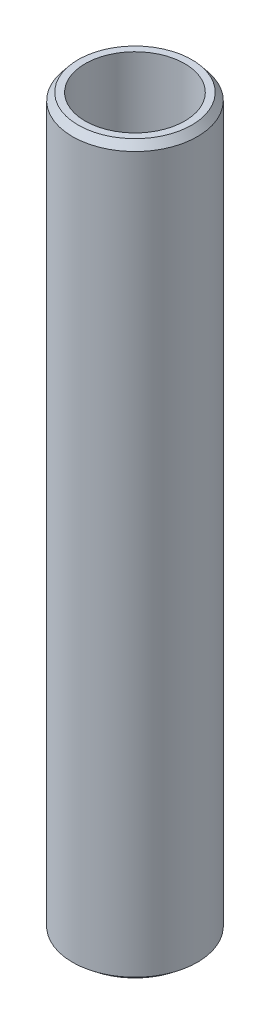
ISO-10303-21;
HEADER;
FILE_DESCRIPTION(('STEP AP214'),'2;1');
FILE_NAME('part.step','',(''),(''),'','','');
FILE_SCHEMA(('AUTOMOTIVE_DESIGN { 1 0 10303 214 1 1 1 1 }'));
ENDSEC;
DATA;
#1=APPLICATION_CONTEXT('core data for automotive mechanical design processes');
#2=APPLICATION_PROTOCOL_DEFINITION('international standard','automotive_design',2000,#1);
#3=PRODUCT_CONTEXT('',#1,'mechanical');
#4=PRODUCT('Part','Part','',(#3));
#5=PRODUCT_RELATED_PRODUCT_CATEGORY('part','',(#4));
#6=PRODUCT_DEFINITION_FORMATION('','',#4);
#7=PRODUCT_DEFINITION_CONTEXT('part definition',#1,'design');
#8=PRODUCT_DEFINITION('design','',#6,#7);
#9=PRODUCT_DEFINITION_SHAPE('','',#8);
#10=(LENGTH_UNIT() NAMED_UNIT(*) SI_UNIT(.MILLI.,.METRE.));
#11=(NAMED_UNIT(*) PLANE_ANGLE_UNIT() SI_UNIT($,.RADIAN.));
#12=(NAMED_UNIT(*) SI_UNIT($,.STERADIAN.) SOLID_ANGLE_UNIT());
#13=UNCERTAINTY_MEASURE_WITH_UNIT(LENGTH_MEASURE(1.E-05),#10,'distance_accuracy_value','');
#14=(GEOMETRIC_REPRESENTATION_CONTEXT(3) GLOBAL_UNCERTAINTY_ASSIGNED_CONTEXT((#13)) GLOBAL_UNIT_ASSIGNED_CONTEXT((#10,
#11,#12)) REPRESENTATION_CONTEXT('',''));
#15=CARTESIAN_POINT('',(0.,0.,0.));
#16=DIRECTION('',(0.,0.,1.));
#17=DIRECTION('',(1.,0.,0.));
#18=AXIS2_PLACEMENT_3D('',#15,#16,#17);
#19=CARTESIAN_POINT('',(0.,262.145483904681,0.));
#20=DIRECTION('',(0.,-1.,0.));
#21=DIRECTION('',(0.,0.,-1.));
#22=AXIS2_PLACEMENT_3D('',#19,#20,#21);
#23=CYLINDRICAL_SURFACE('',#22,22.5);
#24=CARTESIAN_POINT('',(0.,259.579594806273,0.));
#25=DIRECTION('',(0.,1.,0.));
#26=DIRECTION('',(0.,0.,1.));
#27=AXIS2_PLACEMENT_3D('',#24,#25,#26);
#28=CIRCLE('',#27,22.5);
#29=CARTESIAN_POINT('',(0.,259.579594806273,22.5));
#30=VERTEX_POINT('',#29);
#31=EDGE_CURVE('E50',#30,#30,#28,.F.);
#32=ORIENTED_EDGE('',*,*,#31,.T.);
#33=EDGE_LOOP('',(#32));
#34=FACE_BOUND('',#33,.T.);
#35=CARTESIAN_POINT('',(0.,2.05428594744578,0.));
#36=DIRECTION('',(0.,1.,0.));
#37=DIRECTION('',(0.,0.,1.));
#38=AXIS2_PLACEMENT_3D('',#35,#36,#37);
#39=CIRCLE('',#38,22.5);
#40=CARTESIAN_POINT('',(0.,2.05428594744578,22.5));
#41=VERTEX_POINT('',#40);
#42=EDGE_CURVE('E51',#41,#41,#39,.T.);
#43=ORIENTED_EDGE('',*,*,#42,.T.);
#44=EDGE_LOOP('',(#43));
#45=FACE_BOUND('',#44,.T.);
#46=ADVANCED_FACE('F39',(#34,#45),#23,.T.);
#47=CARTESIAN_POINT('',(0.,262.145483904681,0.));
#48=DIRECTION('',(0.,1.,0.));
#49=DIRECTION('',(0.,0.,1.));
#50=AXIS2_PLACEMENT_3D('',#47,#48,#49);
#51=PLANE('',#50);
#52=CARTESIAN_POINT('',(0.,262.145483904681,0.));
#53=DIRECTION('',(0.,1.,0.));
#54=DIRECTION('',(0.,0.,1.));
#55=AXIS2_PLACEMENT_3D('',#52,#53,#54);
#56=CIRCLE('',#55,20.4457140525542);
#57=CARTESIAN_POINT('',(0.,262.145483904681,20.4457140525542));
#58=VERTEX_POINT('',#57);
#59=EDGE_CURVE('E54',#58,#58,#56,.T.);
#60=ORIENTED_EDGE('',*,*,#59,.T.);
#61=EDGE_LOOP('',(#60));
#62=FACE_BOUND('',#61,.T.);
#63=CARTESIAN_POINT('',(0.,262.145483904681,0.));
#64=DIRECTION('',(0.,1.,0.));
#65=DIRECTION('',(0.,0.,1.));
#66=AXIS2_PLACEMENT_3D('',#63,#64,#65);
#67=CIRCLE('',#66,17.9255346033193);
#68=CARTESIAN_POINT('',(0.,262.145483904681,17.9255346033193));
#69=VERTEX_POINT('',#68);
#70=EDGE_CURVE('E58',#69,#69,#67,.T.);
#71=ORIENTED_EDGE('',*,*,#70,.F.);
#72=EDGE_LOOP('',(#71));
#73=FACE_BOUND('',#72,.T.);
#74=ADVANCED_FACE('F69',(#62,#73),#51,.T.);
#75=CARTESIAN_POINT('',(0.,0.,0.));
#76=DIRECTION('',(0.,1.,0.));
#77=DIRECTION('',(0.,0.,1.));
#78=AXIS2_PLACEMENT_3D('',#75,#76,#77);
#79=PLANE('',#78);
#80=CARTESIAN_POINT('',(0.,0.,0.));
#81=DIRECTION('',(0.,1.,0.));
#82=DIRECTION('',(0.,0.,1.));
#83=AXIS2_PLACEMENT_3D('',#80,#81,#82);
#84=CIRCLE('',#83,19.9341109015926);
#85=CARTESIAN_POINT('',(0.,0.,19.9341109015926));
#86=VERTEX_POINT('',#85);
#87=EDGE_CURVE('E10',#86,#86,#84,.F.);
#88=ORIENTED_EDGE('',*,*,#87,.T.);
#89=EDGE_LOOP('',(#88));
#90=FACE_BOUND('',#89,.T.);
#91=CARTESIAN_POINT('',(0.,0.,0.));
#92=DIRECTION('',(0.,1.,0.));
#93=DIRECTION('',(0.,0.,1.));
#94=AXIS2_PLACEMENT_3D('',#91,#92,#93);
#95=CIRCLE('',#94,17.9255346033193);
#96=CARTESIAN_POINT('',(0.,0.,17.9255346033193));
#97=VERTEX_POINT('',#96);
#98=EDGE_CURVE('E63',#97,#97,#95,.T.);
#99=ORIENTED_EDGE('',*,*,#98,.T.);
#100=EDGE_LOOP('',(#99));
#101=FACE_BOUND('',#100,.T.);
#102=ADVANCED_FACE('F75',(#90,#101),#79,.F.);
#103=CARTESIAN_POINT('',(0.,262.145483904681,0.));
#104=DIRECTION('',(0.,-1.,0.));
#105=DIRECTION('',(0.,0.,-1.));
#106=AXIS2_PLACEMENT_3D('',#103,#104,#105);
#107=CYLINDRICAL_SURFACE('',#106,17.9255346033193);
#108=ORIENTED_EDGE('',*,*,#70,.T.);
#109=EDGE_LOOP('',(#108));
#110=FACE_BOUND('',#109,.T.);
#111=ORIENTED_EDGE('',*,*,#98,.F.);
#112=EDGE_LOOP('',(#111));
#113=FACE_BOUND('',#112,.T.);
#114=ADVANCED_FACE('F70',(#110,#113),#107,.F.);
#115=CARTESIAN_POINT('',(0.,262.145483904681,0.));
#116=DIRECTION('',(0.,-1.,0.));
#117=DIRECTION('',(0.,0.,-1.));
#118=AXIS2_PLACEMENT_3D('',#115,#116,#117);
#119=CONICAL_SURFACE('',#118,20.4457140525542,0.675115033394647);
#120=ORIENTED_EDGE('',*,*,#31,.F.);
#121=EDGE_LOOP('',(#120));
#122=FACE_BOUND('',#121,.T.);
#123=ORIENTED_EDGE('',*,*,#59,.F.);
#124=EDGE_LOOP('',(#123));
#125=FACE_BOUND('',#124,.T.);
#126=ADVANCED_FACE('F81',(#122,#125),#119,.T.);
#127=CARTESIAN_POINT('',(0.,2.05428594744578,0.));
#128=DIRECTION('',(0.,1.,0.));
#129=DIRECTION('',(0.,0.,1.));
#130=AXIS2_PLACEMENT_3D('',#127,#128,#129);
#131=CONICAL_SURFACE('',#130,22.5,0.895681293400252);
#132=ORIENTED_EDGE('',*,*,#87,.F.);
#133=EDGE_LOOP('',(#132));
#134=FACE_BOUND('',#133,.T.);
#135=ORIENTED_EDGE('',*,*,#42,.F.);
#136=EDGE_LOOP('',(#135));
#137=FACE_BOUND('',#136,.T.);
#138=ADVANCED_FACE('F45',(#134,#137),#131,.T.);
#139=CLOSED_SHELL('',(#46,#74,#102,#114,#126,#138));
#140=MANIFOLD_SOLID_BREP('B2',#139);
#141=ADVANCED_BREP_SHAPE_REPRESENTATION('',(#18,#140),#14);
#142=SHAPE_DEFINITION_REPRESENTATION(#9,#141);
ENDSEC;
END-ISO-10303-21;
